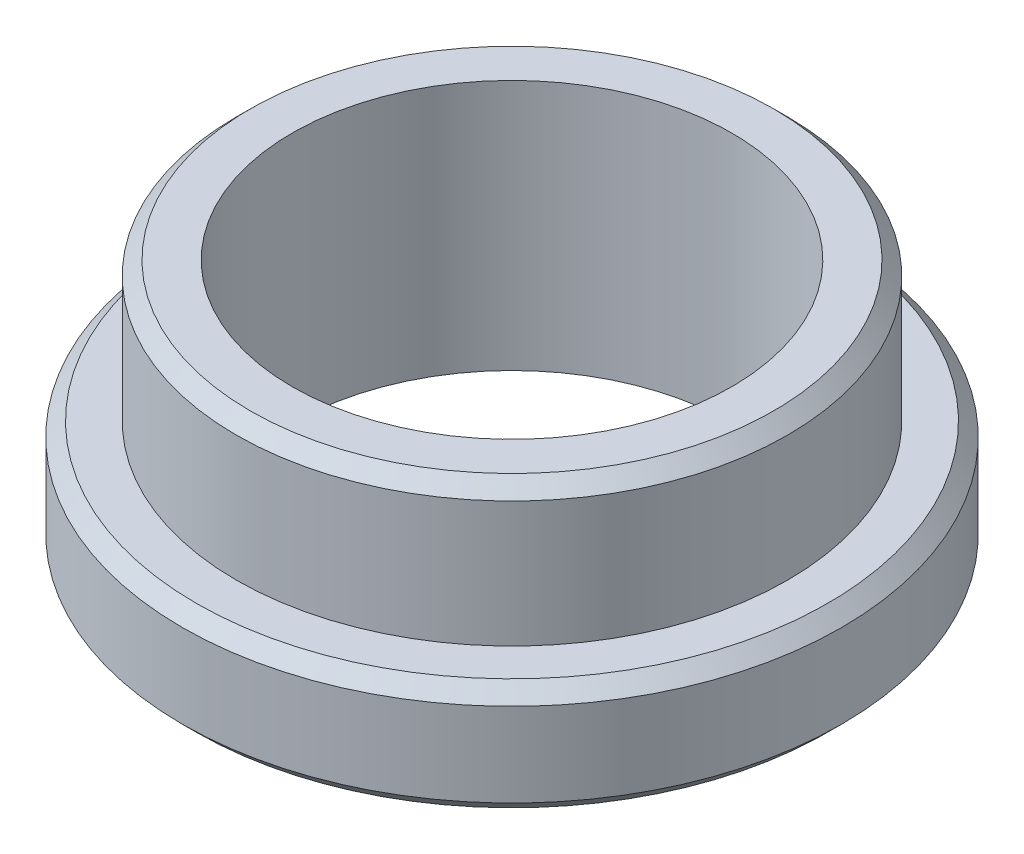
ISO-10303-21;
HEADER;
FILE_DESCRIPTION(('STEP AP214'),'2;1');
FILE_NAME('part.step','',(''),(''),'','','');
FILE_SCHEMA(('AUTOMOTIVE_DESIGN { 1 0 10303 214 1 1 1 1 }'));
ENDSEC;
DATA;
#1=APPLICATION_CONTEXT('core data for automotive mechanical design processes');
#2=APPLICATION_PROTOCOL_DEFINITION('international standard','automotive_design',2000,#1);
#3=PRODUCT_CONTEXT('',#1,'mechanical');
#4=PRODUCT('Part','Part','',(#3));
#5=PRODUCT_RELATED_PRODUCT_CATEGORY('part','',(#4));
#6=PRODUCT_DEFINITION_FORMATION('','',#4);
#7=PRODUCT_DEFINITION_CONTEXT('part definition',#1,'design');
#8=PRODUCT_DEFINITION('design','',#6,#7);
#9=PRODUCT_DEFINITION_SHAPE('','',#8);
#10=(LENGTH_UNIT() NAMED_UNIT(*) SI_UNIT(.MILLI.,.METRE.));
#11=(NAMED_UNIT(*) PLANE_ANGLE_UNIT() SI_UNIT($,.RADIAN.));
#12=(NAMED_UNIT(*) SI_UNIT($,.STERADIAN.) SOLID_ANGLE_UNIT());
#13=UNCERTAINTY_MEASURE_WITH_UNIT(LENGTH_MEASURE(1.E-05),#10,'distance_accuracy_value','');
#14=(GEOMETRIC_REPRESENTATION_CONTEXT(3) GLOBAL_UNCERTAINTY_ASSIGNED_CONTEXT((#13)) GLOBAL_UNIT_ASSIGNED_CONTEXT((#10,
#11,#12)) REPRESENTATION_CONTEXT('',''));
#15=CARTESIAN_POINT('',(0.,0.,0.));
#16=DIRECTION('',(0.,0.,1.));
#17=DIRECTION('',(1.,0.,0.));
#18=AXIS2_PLACEMENT_3D('',#15,#16,#17);
#19=CARTESIAN_POINT('',(4.,0.,0.));
#20=DIRECTION('',(0.,-1.,0.));
#21=DIRECTION('',(0.,0.,-1.));
#22=AXIS2_PLACEMENT_3D('',#19,#20,#21);
#23=PLANE('',#22);
#24=CARTESIAN_POINT('',(0.,0.,0.));
#25=DIRECTION('',(0.,-1.,0.));
#26=DIRECTION('',(0.,0.,-1.));
#27=AXIS2_PLACEMENT_3D('',#24,#25,#26);
#28=CIRCLE('',#27,4.762);
#29=CARTESIAN_POINT('',(0.,0.,-4.762));
#30=VERTEX_POINT('',#29);
#31=EDGE_CURVE('E44',#30,#30,#28,.F.);
#32=ORIENTED_EDGE('',*,*,#31,.T.);
#33=EDGE_LOOP('',(#32));
#34=FACE_BOUND('',#33,.T.);
#35=CARTESIAN_POINT('',(0.,0.,0.));
#36=DIRECTION('',(0.,1.,0.));
#37=DIRECTION('',(0.,0.,1.));
#38=AXIS2_PLACEMENT_3D('',#35,#36,#37);
#39=CIRCLE('',#38,4.);
#40=CARTESIAN_POINT('',(0.,0.,4.));
#41=VERTEX_POINT('',#40);
#42=EDGE_CURVE('E77',#41,#41,#39,.T.);
#43=ORIENTED_EDGE('',*,*,#42,.F.);
#44=EDGE_LOOP('',(#43));
#45=FACE_BOUND('',#44,.T.);
#46=ADVANCED_FACE('F36',(#34,#45),#23,.F.);
#47=CARTESIAN_POINT('',(0.,0.,0.));
#48=DIRECTION('',(0.,1.,0.));
#49=DIRECTION('',(0.,0.,1.));
#50=AXIS2_PLACEMENT_3D('',#47,#48,#49);
#51=CYLINDRICAL_SURFACE('',#50,5.016);
#52=CARTESIAN_POINT('',(0.,-0.254000000000001,0.));
#53=DIRECTION('',(0.,-1.,0.));
#54=DIRECTION('',(0.,0.,-1.));
#55=AXIS2_PLACEMENT_3D('',#52,#53,#54);
#56=CIRCLE('',#55,5.016);
#57=CARTESIAN_POINT('',(0.,-0.254000000000001,-5.016));
#58=VERTEX_POINT('',#57);
#59=EDGE_CURVE('E10',#58,#58,#56,.T.);
#60=ORIENTED_EDGE('',*,*,#59,.T.);
#61=EDGE_LOOP('',(#60));
#62=FACE_BOUND('',#61,.T.);
#63=CARTESIAN_POINT('',(0.,-2.54,0.));
#64=DIRECTION('',(0.,1.,0.));
#65=DIRECTION('',(0.,0.,1.));
#66=AXIS2_PLACEMENT_3D('',#63,#64,#65);
#67=CIRCLE('',#66,5.016);
#68=CARTESIAN_POINT('',(0.,-2.54,5.016));
#69=VERTEX_POINT('',#68);
#70=EDGE_CURVE('E70',#69,#69,#67,.T.);
#71=ORIENTED_EDGE('',*,*,#70,.T.);
#72=EDGE_LOOP('',(#71));
#73=FACE_BOUND('',#72,.T.);
#74=ADVANCED_FACE('F84',(#62,#73),#51,.T.);
#75=CARTESIAN_POINT('',(5.016,-2.54,0.));
#76=DIRECTION('',(0.,-1.,0.));
#77=DIRECTION('',(0.,0.,-1.));
#78=AXIS2_PLACEMENT_3D('',#75,#76,#77);
#79=PLANE('',#78);
#80=CARTESIAN_POINT('',(0.,-2.54,0.));
#81=DIRECTION('',(0.,-1.,0.));
#82=DIRECTION('',(0.,0.,-1.));
#83=AXIS2_PLACEMENT_3D('',#80,#81,#82);
#84=CIRCLE('',#83,5.74600000000001);
#85=CARTESIAN_POINT('',(0.,-2.54,-5.74600000000001));
#86=VERTEX_POINT('',#85);
#87=EDGE_CURVE('E50',#86,#86,#84,.F.);
#88=ORIENTED_EDGE('',*,*,#87,.T.);
#89=EDGE_LOOP('',(#88));
#90=FACE_BOUND('',#89,.T.);
#91=ORIENTED_EDGE('',*,*,#70,.F.);
#92=EDGE_LOOP('',(#91));
#93=FACE_BOUND('',#92,.T.);
#94=ADVANCED_FACE('F89',(#90,#93),#79,.F.);
#95=CARTESIAN_POINT('',(0.,0.,0.));
#96=DIRECTION('',(0.,1.,0.));
#97=DIRECTION('',(0.,0.,1.));
#98=AXIS2_PLACEMENT_3D('',#95,#96,#97);
#99=CYLINDRICAL_SURFACE('',#98,6.);
#100=CARTESIAN_POINT('',(0.,-4.318,0.));
#101=DIRECTION('',(0.,1.,0.));
#102=DIRECTION('',(0.,0.,1.));
#103=AXIS2_PLACEMENT_3D('',#100,#101,#102);
#104=CIRCLE('',#103,6.);
#105=CARTESIAN_POINT('',(0.,-4.318,6.));
#106=VERTEX_POINT('',#105);
#107=EDGE_CURVE('E62',#106,#106,#104,.T.);
#108=ORIENTED_EDGE('',*,*,#107,.T.);
#109=EDGE_LOOP('',(#108));
#110=FACE_BOUND('',#109,.T.);
#111=CARTESIAN_POINT('',(0.,-2.794,0.));
#112=DIRECTION('',(0.,-1.,0.));
#113=DIRECTION('',(0.,0.,-1.));
#114=AXIS2_PLACEMENT_3D('',#111,#112,#113);
#115=CIRCLE('',#114,6.);
#116=CARTESIAN_POINT('',(0.,-2.794,-6.));
#117=VERTEX_POINT('',#116);
#118=EDGE_CURVE('E66',#117,#117,#115,.T.);
#119=ORIENTED_EDGE('',*,*,#118,.T.);
#120=EDGE_LOOP('',(#119));
#121=FACE_BOUND('',#120,.T.);
#122=ADVANCED_FACE('F109',(#110,#121),#99,.T.);
#123=CARTESIAN_POINT('',(6.,-4.572,0.));
#124=DIRECTION('',(0.,1.,0.));
#125=DIRECTION('',(0.,0.,1.));
#126=AXIS2_PLACEMENT_3D('',#123,#124,#125);
#127=PLANE('',#126);
#128=CARTESIAN_POINT('',(0.,-4.572,0.));
#129=DIRECTION('',(0.,1.,0.));
#130=DIRECTION('',(0.,0.,1.));
#131=AXIS2_PLACEMENT_3D('',#128,#129,#130);
#132=CIRCLE('',#131,5.746);
#133=CARTESIAN_POINT('',(0.,-4.572,5.746));
#134=VERTEX_POINT('',#133);
#135=EDGE_CURVE('E56',#134,#134,#132,.F.);
#136=ORIENTED_EDGE('',*,*,#135,.T.);
#137=EDGE_LOOP('',(#136));
#138=FACE_BOUND('',#137,.T.);
#139=CARTESIAN_POINT('',(0.,-4.572,0.));
#140=DIRECTION('',(0.,1.,0.));
#141=DIRECTION('',(0.,0.,1.));
#142=AXIS2_PLACEMENT_3D('',#139,#140,#141);
#143=CIRCLE('',#142,4.);
#144=CARTESIAN_POINT('',(0.,-4.572,4.));
#145=VERTEX_POINT('',#144);
#146=EDGE_CURVE('E74',#145,#145,#143,.T.);
#147=ORIENTED_EDGE('',*,*,#146,.T.);
#148=EDGE_LOOP('',(#147));
#149=FACE_BOUND('',#148,.T.);
#150=ADVANCED_FACE('F115',(#138,#149),#127,.F.);
#151=CARTESIAN_POINT('',(0.,0.,0.));
#152=DIRECTION('',(0.,1.,0.));
#153=DIRECTION('',(0.,0.,1.));
#154=AXIS2_PLACEMENT_3D('',#151,#152,#153);
#155=CYLINDRICAL_SURFACE('',#154,4.);
#156=ORIENTED_EDGE('',*,*,#146,.F.);
#157=EDGE_LOOP('',(#156));
#158=FACE_BOUND('',#157,.T.);
#159=ORIENTED_EDGE('',*,*,#42,.T.);
#160=EDGE_LOOP('',(#159));
#161=FACE_BOUND('',#160,.T.);
#162=ADVANCED_FACE('F81',(#158,#161),#155,.F.);
#163=CARTESIAN_POINT('',(0.,-4.318,0.));
#164=DIRECTION('',(0.,1.,0.));
#165=DIRECTION('',(0.,0.,1.));
#166=AXIS2_PLACEMENT_3D('',#163,#164,#165);
#167=CONICAL_SURFACE('',#166,6.,0.785398163397452);
#168=ORIENTED_EDGE('',*,*,#135,.F.);
#169=EDGE_LOOP('',(#168));
#170=FACE_BOUND('',#169,.T.);
#171=ORIENTED_EDGE('',*,*,#107,.F.);
#172=EDGE_LOOP('',(#171));
#173=FACE_BOUND('',#172,.T.);
#174=ADVANCED_FACE('F93',(#170,#173),#167,.T.);
#175=CARTESIAN_POINT('',(0.,-2.54,0.));
#176=DIRECTION('',(0.,-1.,0.));
#177=DIRECTION('',(0.,0.,-1.));
#178=AXIS2_PLACEMENT_3D('',#175,#176,#177);
#179=CONICAL_SURFACE('',#178,5.74600000000001,0.785398163397443);
#180=ORIENTED_EDGE('',*,*,#118,.F.);
#181=EDGE_LOOP('',(#180));
#182=FACE_BOUND('',#181,.T.);
#183=ORIENTED_EDGE('',*,*,#87,.F.);
#184=EDGE_LOOP('',(#183));
#185=FACE_BOUND('',#184,.T.);
#186=ADVANCED_FACE('F95',(#182,#185),#179,.T.);
#187=CARTESIAN_POINT('',(0.,0.,0.));
#188=DIRECTION('',(0.,-1.,0.));
#189=DIRECTION('',(0.,0.,-1.));
#190=AXIS2_PLACEMENT_3D('',#187,#188,#189);
#191=CONICAL_SURFACE('',#190,4.762,0.785398163397452);
#192=ORIENTED_EDGE('',*,*,#59,.F.);
#193=EDGE_LOOP('',(#192));
#194=FACE_BOUND('',#193,.T.);
#195=ORIENTED_EDGE('',*,*,#31,.F.);
#196=EDGE_LOOP('',(#195));
#197=FACE_BOUND('',#196,.T.);
#198=ADVANCED_FACE('F38',(#194,#197),#191,.T.);
#199=CLOSED_SHELL('',(#46,#74,#94,#122,#150,#162,#174,#186,#198));
#200=MANIFOLD_SOLID_BREP('B2',#199);
#201=ADVANCED_BREP_SHAPE_REPRESENTATION('',(#18,#200),#14);
#202=SHAPE_DEFINITION_REPRESENTATION(#9,#201);
ENDSEC;
END-ISO-10303-21;
